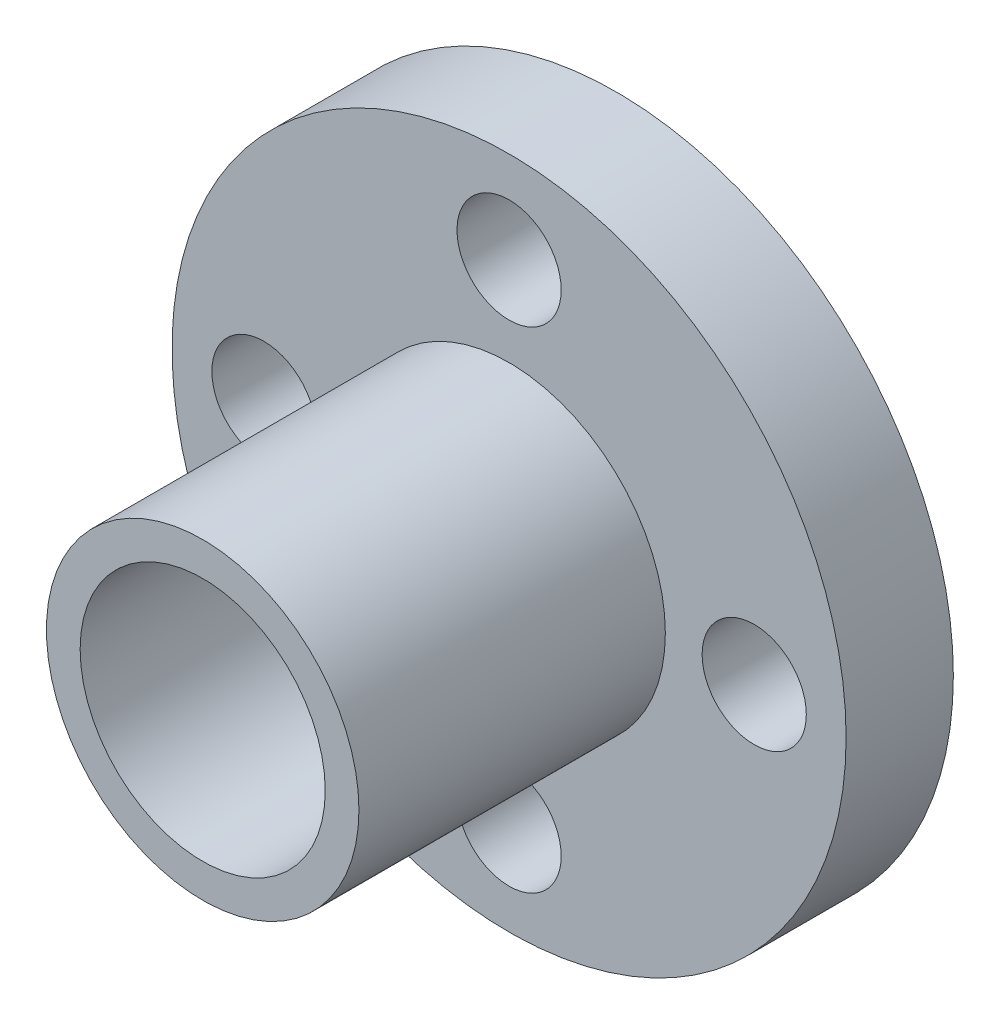
ISO-10303-21;
HEADER;
FILE_DESCRIPTION(('STEP AP214'),'2;1');
FILE_NAME('part.step','',(''),(''),'','','');
FILE_SCHEMA(('AUTOMOTIVE_DESIGN { 1 0 10303 214 1 1 1 1 }'));
ENDSEC;
DATA;
#1=APPLICATION_CONTEXT('core data for automotive mechanical design processes');
#2=APPLICATION_PROTOCOL_DEFINITION('international standard','automotive_design',2000,#1);
#3=PRODUCT_CONTEXT('',#1,'mechanical');
#4=PRODUCT('Part','Part','',(#3));
#5=PRODUCT_RELATED_PRODUCT_CATEGORY('part','',(#4));
#6=PRODUCT_DEFINITION_FORMATION('','',#4);
#7=PRODUCT_DEFINITION_CONTEXT('part definition',#1,'design');
#8=PRODUCT_DEFINITION('design','',#6,#7);
#9=PRODUCT_DEFINITION_SHAPE('','',#8);
#10=(LENGTH_UNIT() NAMED_UNIT(*) SI_UNIT(.MILLI.,.METRE.));
#11=(NAMED_UNIT(*) PLANE_ANGLE_UNIT() SI_UNIT($,.RADIAN.));
#12=(NAMED_UNIT(*) SI_UNIT($,.STERADIAN.) SOLID_ANGLE_UNIT());
#13=UNCERTAINTY_MEASURE_WITH_UNIT(LENGTH_MEASURE(1.E-05),#10,'distance_accuracy_value','');
#14=(GEOMETRIC_REPRESENTATION_CONTEXT(3) GLOBAL_UNCERTAINTY_ASSIGNED_CONTEXT((#13)) GLOBAL_UNIT_ASSIGNED_CONTEXT((#10,
#11,#12)) REPRESENTATION_CONTEXT('',''));
#15=CARTESIAN_POINT('',(0.,0.,0.));
#16=DIRECTION('',(0.,0.,1.));
#17=DIRECTION('',(1.,0.,0.));
#18=AXIS2_PLACEMENT_3D('',#15,#16,#17);
#19=CARTESIAN_POINT('',(0.,0.,0.));
#20=DIRECTION('',(0.,0.,1.));
#21=DIRECTION('',(1.,0.,0.));
#22=AXIS2_PLACEMENT_3D('',#19,#20,#21);
#23=PLANE('',#22);
#24=CARTESIAN_POINT('',(0.,8.,0.));
#25=DIRECTION('',(0.,0.,-1.));
#26=DIRECTION('',(-1.,0.,0.));
#27=AXIS2_PLACEMENT_3D('',#24,#25,#26);
#28=CIRCLE('',#27,1.7);
#29=CARTESIAN_POINT('',(-1.7,8.,0.));
#30=VERTEX_POINT('',#29);
#31=EDGE_CURVE('E68',#30,#30,#28,.T.);
#32=ORIENTED_EDGE('',*,*,#31,.F.);
#33=EDGE_LOOP('',(#32));
#34=FACE_BOUND('',#33,.T.);
#35=CARTESIAN_POINT('',(-8.,0.,0.));
#36=DIRECTION('',(0.,0.,-1.));
#37=DIRECTION('',(-1.,0.,0.));
#38=AXIS2_PLACEMENT_3D('',#35,#36,#37);
#39=CIRCLE('',#38,1.7);
#40=CARTESIAN_POINT('',(-9.7,0.,0.));
#41=VERTEX_POINT('',#40);
#42=EDGE_CURVE('E58',#41,#41,#39,.T.);
#43=ORIENTED_EDGE('',*,*,#42,.F.);
#44=EDGE_LOOP('',(#43));
#45=FACE_BOUND('',#44,.T.);
#46=CARTESIAN_POINT('',(0.,-8.,0.));
#47=DIRECTION('',(0.,0.,-1.));
#48=DIRECTION('',(-1.,0.,0.));
#49=AXIS2_PLACEMENT_3D('',#46,#47,#48);
#50=CIRCLE('',#49,1.7);
#51=CARTESIAN_POINT('',(-1.7,-8.,0.));
#52=VERTEX_POINT('',#51);
#53=EDGE_CURVE('E55',#52,#52,#50,.T.);
#54=ORIENTED_EDGE('',*,*,#53,.F.);
#55=EDGE_LOOP('',(#54));
#56=FACE_BOUND('',#55,.T.);
#57=CARTESIAN_POINT('',(0.,0.,0.));
#58=DIRECTION('',(0.,0.,1.));
#59=DIRECTION('',(1.,0.,0.));
#60=AXIS2_PLACEMENT_3D('',#57,#58,#59);
#61=CIRCLE('',#60,5.1);
#62=CARTESIAN_POINT('',(5.1,0.,0.));
#63=VERTEX_POINT('',#62);
#64=EDGE_CURVE('E80',#63,#63,#61,.T.);
#65=ORIENTED_EDGE('',*,*,#64,.T.);
#66=EDGE_LOOP('',(#65));
#67=FACE_BOUND('',#66,.T.);
#68=CARTESIAN_POINT('',(0.,0.,0.));
#69=DIRECTION('',(0.,0.,1.));
#70=DIRECTION('',(1.,0.,0.));
#71=AXIS2_PLACEMENT_3D('',#68,#69,#70);
#72=CIRCLE('',#71,11.);
#73=CARTESIAN_POINT('',(11.,0.,0.));
#74=VERTEX_POINT('',#73);
#75=EDGE_CURVE('E44',#74,#74,#72,.T.);
#76=ORIENTED_EDGE('',*,*,#75,.F.);
#77=EDGE_LOOP('',(#76));
#78=FACE_BOUND('',#77,.T.);
#79=CARTESIAN_POINT('',(8.,0.,0.));
#80=DIRECTION('',(0.,0.,-1.));
#81=DIRECTION('',(-1.,0.,0.));
#82=AXIS2_PLACEMENT_3D('',#79,#80,#81);
#83=CIRCLE('',#82,1.7);
#84=CARTESIAN_POINT('',(6.3,0.,0.));
#85=VERTEX_POINT('',#84);
#86=EDGE_CURVE('E54',#85,#85,#83,.T.);
#87=ORIENTED_EDGE('',*,*,#86,.F.);
#88=EDGE_LOOP('',(#87));
#89=FACE_BOUND('',#88,.T.);
#90=ADVANCED_FACE('F31',(#34,#45,#56,#67,#78,#89),#23,.F.);
#91=CARTESIAN_POINT('',(0.,0.,3.5));
#92=DIRECTION('',(0.,0.,-1.));
#93=DIRECTION('',(-1.,0.,0.));
#94=AXIS2_PLACEMENT_3D('',#91,#92,#93);
#95=CYLINDRICAL_SURFACE('',#94,11.);
#96=CARTESIAN_POINT('',(0.,0.,3.5));
#97=DIRECTION('',(0.,0.,1.));
#98=DIRECTION('',(1.,0.,0.));
#99=AXIS2_PLACEMENT_3D('',#96,#97,#98);
#100=CIRCLE('',#99,11.);
#101=CARTESIAN_POINT('',(11.,0.,3.5));
#102=VERTEX_POINT('',#101);
#103=EDGE_CURVE('E39',#102,#102,#100,.T.);
#104=ORIENTED_EDGE('',*,*,#103,.F.);
#105=EDGE_LOOP('',(#104));
#106=FACE_BOUND('',#105,.T.);
#107=ORIENTED_EDGE('',*,*,#75,.T.);
#108=EDGE_LOOP('',(#107));
#109=FACE_BOUND('',#108,.T.);
#110=ADVANCED_FACE('F33',(#106,#109),#95,.T.);
#111=CARTESIAN_POINT('',(0.,0.,3.5));
#112=DIRECTION('',(0.,0.,1.));
#113=DIRECTION('',(1.,0.,0.));
#114=AXIS2_PLACEMENT_3D('',#111,#112,#113);
#115=PLANE('',#114);
#116=CARTESIAN_POINT('',(0.,8.,3.5));
#117=DIRECTION('',(0.,0.,1.));
#118=DIRECTION('',(1.,0.,0.));
#119=AXIS2_PLACEMENT_3D('',#116,#117,#118);
#120=CIRCLE('',#119,1.7);
#121=CARTESIAN_POINT('',(1.7,8.,3.5));
#122=VERTEX_POINT('',#121);
#123=EDGE_CURVE('E35',#122,#122,#120,.T.);
#124=ORIENTED_EDGE('',*,*,#123,.F.);
#125=EDGE_LOOP('',(#124));
#126=FACE_BOUND('',#125,.T.);
#127=CARTESIAN_POINT('',(-8.,0.,3.5));
#128=DIRECTION('',(0.,0.,1.));
#129=DIRECTION('',(1.,0.,0.));
#130=AXIS2_PLACEMENT_3D('',#127,#128,#129);
#131=CIRCLE('',#130,1.7);
#132=CARTESIAN_POINT('',(-6.3,0.,3.5));
#133=VERTEX_POINT('',#132);
#134=EDGE_CURVE('E56',#133,#133,#131,.T.);
#135=ORIENTED_EDGE('',*,*,#134,.F.);
#136=EDGE_LOOP('',(#135));
#137=FACE_BOUND('',#136,.T.);
#138=CARTESIAN_POINT('',(0.,-8.,3.5));
#139=DIRECTION('',(0.,0.,1.));
#140=DIRECTION('',(1.,0.,0.));
#141=AXIS2_PLACEMENT_3D('',#138,#139,#140);
#142=CIRCLE('',#141,1.7);
#143=CARTESIAN_POINT('',(1.7,-8.,3.5));
#144=VERTEX_POINT('',#143);
#145=EDGE_CURVE('E52',#144,#144,#142,.T.);
#146=ORIENTED_EDGE('',*,*,#145,.F.);
#147=EDGE_LOOP('',(#146));
#148=FACE_BOUND('',#147,.T.);
#149=CARTESIAN_POINT('',(8.,0.,3.5));
#150=DIRECTION('',(0.,0.,1.));
#151=DIRECTION('',(1.,0.,0.));
#152=AXIS2_PLACEMENT_3D('',#149,#150,#151);
#153=CIRCLE('',#152,1.7);
#154=CARTESIAN_POINT('',(9.7,0.,3.5));
#155=VERTEX_POINT('',#154);
#156=EDGE_CURVE('E73',#155,#155,#153,.T.);
#157=ORIENTED_EDGE('',*,*,#156,.F.);
#158=EDGE_LOOP('',(#157));
#159=FACE_BOUND('',#158,.T.);
#160=CARTESIAN_POINT('',(0.,0.,3.5));
#161=DIRECTION('',(0.,0.,1.));
#162=DIRECTION('',(1.,0.,0.));
#163=AXIS2_PLACEMENT_3D('',#160,#161,#162);
#164=CIRCLE('',#163,5.1);
#165=CARTESIAN_POINT('',(5.1,0.,3.5));
#166=VERTEX_POINT('',#165);
#167=EDGE_CURVE('E10',#166,#166,#164,.T.);
#168=ORIENTED_EDGE('',*,*,#167,.F.);
#169=EDGE_LOOP('',(#168));
#170=FACE_BOUND('',#169,.T.);
#171=ORIENTED_EDGE('',*,*,#103,.T.);
#172=EDGE_LOOP('',(#171));
#173=FACE_BOUND('',#172,.T.);
#174=ADVANCED_FACE('F111',(#126,#137,#148,#159,#170,#173),#115,.T.);
#175=CARTESIAN_POINT('',(0.,0.,13.5));
#176=DIRECTION('',(0.,0.,-1.));
#177=DIRECTION('',(-1.,0.,0.));
#178=AXIS2_PLACEMENT_3D('',#175,#176,#177);
#179=CYLINDRICAL_SURFACE('',#178,5.1);
#180=CARTESIAN_POINT('',(0.,0.,13.5));
#181=DIRECTION('',(0.,0.,1.));
#182=DIRECTION('',(1.,0.,0.));
#183=AXIS2_PLACEMENT_3D('',#180,#181,#182);
#184=CIRCLE('',#183,5.1);
#185=CARTESIAN_POINT('',(5.1,0.,13.5));
#186=VERTEX_POINT('',#185);
#187=EDGE_CURVE('E47',#186,#186,#184,.T.);
#188=ORIENTED_EDGE('',*,*,#187,.F.);
#189=EDGE_LOOP('',(#188));
#190=FACE_BOUND('',#189,.T.);
#191=ORIENTED_EDGE('',*,*,#167,.T.);
#192=EDGE_LOOP('',(#191));
#193=FACE_BOUND('',#192,.T.);
#194=ADVANCED_FACE('F103',(#190,#193),#179,.T.);
#195=CARTESIAN_POINT('',(0.,0.,13.5));
#196=DIRECTION('',(0.,0.,1.));
#197=DIRECTION('',(1.,0.,0.));
#198=AXIS2_PLACEMENT_3D('',#195,#196,#197);
#199=PLANE('',#198);
#200=CARTESIAN_POINT('',(0.,0.,13.5));
#201=DIRECTION('',(0.,0.,-1.));
#202=DIRECTION('',(-1.,0.,0.));
#203=AXIS2_PLACEMENT_3D('',#200,#201,#202);
#204=CIRCLE('',#203,4.);
#205=CARTESIAN_POINT('',(-4.,0.,13.5));
#206=VERTEX_POINT('',#205);
#207=EDGE_CURVE('E77',#206,#206,#204,.T.);
#208=ORIENTED_EDGE('',*,*,#207,.T.);
#209=EDGE_LOOP('',(#208));
#210=FACE_BOUND('',#209,.T.);
#211=ORIENTED_EDGE('',*,*,#187,.T.);
#212=EDGE_LOOP('',(#211));
#213=FACE_BOUND('',#212,.T.);
#214=ADVANCED_FACE('F93',(#210,#213),#199,.T.);
#215=CARTESIAN_POINT('',(0.,0.,-1.5));
#216=DIRECTION('',(0.,0.,1.));
#217=DIRECTION('',(1.,0.,0.));
#218=AXIS2_PLACEMENT_3D('',#215,#216,#217);
#219=CYLINDRICAL_SURFACE('',#218,5.1);
#220=CARTESIAN_POINT('',(0.,0.,-1.5));
#221=DIRECTION('',(0.,0.,1.));
#222=DIRECTION('',(1.,0.,0.));
#223=AXIS2_PLACEMENT_3D('',#220,#221,#222);
#224=CIRCLE('',#223,5.1);
#225=CARTESIAN_POINT('',(5.1,0.,-1.5));
#226=VERTEX_POINT('',#225);
#227=EDGE_CURVE('E83',#226,#226,#224,.T.);
#228=ORIENTED_EDGE('',*,*,#227,.T.);
#229=EDGE_LOOP('',(#228));
#230=FACE_BOUND('',#229,.T.);
#231=ORIENTED_EDGE('',*,*,#64,.F.);
#232=EDGE_LOOP('',(#231));
#233=FACE_BOUND('',#232,.T.);
#234=ADVANCED_FACE('F90',(#230,#233),#219,.T.);
#235=CARTESIAN_POINT('',(0.,0.,-1.5));
#236=DIRECTION('',(0.,0.,1.));
#237=DIRECTION('',(1.,0.,0.));
#238=AXIS2_PLACEMENT_3D('',#235,#236,#237);
#239=PLANE('',#238);
#240=CARTESIAN_POINT('',(0.,0.,-1.5));
#241=DIRECTION('',(0.,0.,-1.));
#242=DIRECTION('',(-1.,0.,0.));
#243=AXIS2_PLACEMENT_3D('',#240,#241,#242);
#244=CIRCLE('',#243,4.);
#245=CARTESIAN_POINT('',(-4.,0.,-1.5));
#246=VERTEX_POINT('',#245);
#247=EDGE_CURVE('E76',#246,#246,#244,.T.);
#248=ORIENTED_EDGE('',*,*,#247,.F.);
#249=EDGE_LOOP('',(#248));
#250=FACE_BOUND('',#249,.T.);
#251=ORIENTED_EDGE('',*,*,#227,.F.);
#252=EDGE_LOOP('',(#251));
#253=FACE_BOUND('',#252,.T.);
#254=ADVANCED_FACE('F92',(#250,#253),#239,.F.);
#255=CARTESIAN_POINT('',(0.,0.,13.5));
#256=DIRECTION('',(0.,0.,-1.));
#257=DIRECTION('',(-1.,0.,0.));
#258=AXIS2_PLACEMENT_3D('',#255,#256,#257);
#259=CYLINDRICAL_SURFACE('',#258,4.);
#260=ORIENTED_EDGE('',*,*,#207,.F.);
#261=EDGE_LOOP('',(#260));
#262=FACE_BOUND('',#261,.T.);
#263=ORIENTED_EDGE('',*,*,#247,.T.);
#264=EDGE_LOOP('',(#263));
#265=FACE_BOUND('',#264,.T.);
#266=ADVANCED_FACE('F100',(#262,#265),#259,.F.);
#267=CARTESIAN_POINT('',(8.,0.,0.));
#268=DIRECTION('',(0.,0.,-1.));
#269=DIRECTION('',(-1.,0.,0.));
#270=AXIS2_PLACEMENT_3D('',#267,#268,#269);
#271=CYLINDRICAL_SURFACE('',#270,1.7);
#272=ORIENTED_EDGE('',*,*,#156,.T.);
#273=EDGE_LOOP('',(#272));
#274=FACE_BOUND('',#273,.T.);
#275=ORIENTED_EDGE('',*,*,#86,.T.);
#276=EDGE_LOOP('',(#275));
#277=FACE_BOUND('',#276,.T.);
#278=ADVANCED_FACE('F149',(#274,#277),#271,.F.);
#279=CARTESIAN_POINT('',(0.,-8.,0.));
#280=DIRECTION('',(0.,0.,-1.));
#281=DIRECTION('',(-1.,0.,0.));
#282=AXIS2_PLACEMENT_3D('',#279,#280,#281);
#283=CYLINDRICAL_SURFACE('',#282,1.7);
#284=ORIENTED_EDGE('',*,*,#145,.T.);
#285=EDGE_LOOP('',(#284));
#286=FACE_BOUND('',#285,.T.);
#287=ORIENTED_EDGE('',*,*,#53,.T.);
#288=EDGE_LOOP('',(#287));
#289=FACE_BOUND('',#288,.T.);
#290=ADVANCED_FACE('F169',(#286,#289),#283,.F.);
#291=CARTESIAN_POINT('',(-8.,0.,0.));
#292=DIRECTION('',(0.,0.,-1.));
#293=DIRECTION('',(-1.,0.,0.));
#294=AXIS2_PLACEMENT_3D('',#291,#292,#293);
#295=CYLINDRICAL_SURFACE('',#294,1.7);
#296=ORIENTED_EDGE('',*,*,#134,.T.);
#297=EDGE_LOOP('',(#296));
#298=FACE_BOUND('',#297,.T.);
#299=ORIENTED_EDGE('',*,*,#42,.T.);
#300=EDGE_LOOP('',(#299));
#301=FACE_BOUND('',#300,.T.);
#302=ADVANCED_FACE('F179',(#298,#301),#295,.F.);
#303=CARTESIAN_POINT('',(0.,8.,0.));
#304=DIRECTION('',(0.,0.,-1.));
#305=DIRECTION('',(-1.,0.,0.));
#306=AXIS2_PLACEMENT_3D('',#303,#304,#305);
#307=CYLINDRICAL_SURFACE('',#306,1.7);
#308=ORIENTED_EDGE('',*,*,#123,.T.);
#309=EDGE_LOOP('',(#308));
#310=FACE_BOUND('',#309,.T.);
#311=ORIENTED_EDGE('',*,*,#31,.T.);
#312=EDGE_LOOP('',(#311));
#313=FACE_BOUND('',#312,.T.);
#314=ADVANCED_FACE('F189',(#310,#313),#307,.F.);
#315=CLOSED_SHELL('',(#90,#110,#174,#194,#214,#234,#254,#266,#278,#290,#302,#314));
#316=MANIFOLD_SOLID_BREP('B2',#315);
#317=ADVANCED_BREP_SHAPE_REPRESENTATION('',(#18,#316),#14);
#318=SHAPE_DEFINITION_REPRESENTATION(#9,#317);
ENDSEC;
END-ISO-10303-21;
